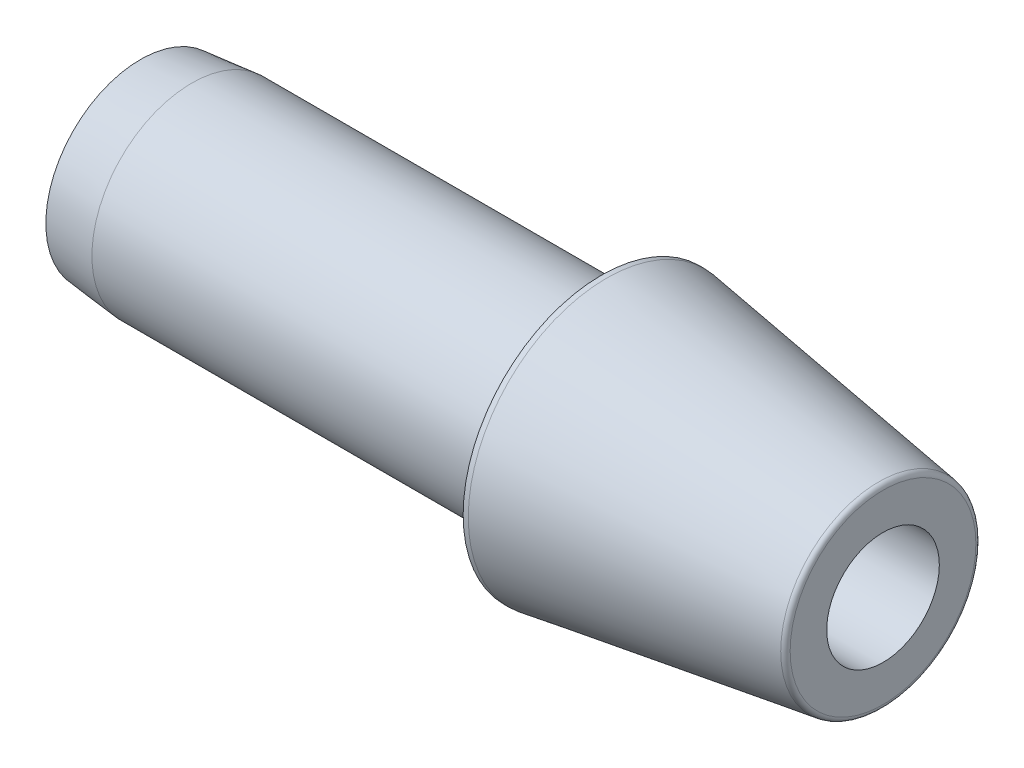
ISO-10303-21;
HEADER;
FILE_DESCRIPTION(('STEP AP214'),'2;1');
FILE_NAME('part.step','',(''),(''),'','','');
FILE_SCHEMA(('AUTOMOTIVE_DESIGN { 1 0 10303 214 1 1 1 1 }'));
ENDSEC;
DATA;
#1=APPLICATION_CONTEXT('core data for automotive mechanical design processes');
#2=APPLICATION_PROTOCOL_DEFINITION('international standard','automotive_design',2000,#1);
#3=PRODUCT_CONTEXT('',#1,'mechanical');
#4=PRODUCT('Part','Part','',(#3));
#5=PRODUCT_RELATED_PRODUCT_CATEGORY('part','',(#4));
#6=PRODUCT_DEFINITION_FORMATION('','',#4);
#7=PRODUCT_DEFINITION_CONTEXT('part definition',#1,'design');
#8=PRODUCT_DEFINITION('design','',#6,#7);
#9=PRODUCT_DEFINITION_SHAPE('','',#8);
#10=(LENGTH_UNIT() NAMED_UNIT(*) SI_UNIT(.MILLI.,.METRE.));
#11=(NAMED_UNIT(*) PLANE_ANGLE_UNIT() SI_UNIT($,.RADIAN.));
#12=(NAMED_UNIT(*) SI_UNIT($,.STERADIAN.) SOLID_ANGLE_UNIT());
#13=UNCERTAINTY_MEASURE_WITH_UNIT(LENGTH_MEASURE(1.E-05),#10,'distance_accuracy_value','');
#14=(GEOMETRIC_REPRESENTATION_CONTEXT(3) GLOBAL_UNCERTAINTY_ASSIGNED_CONTEXT((#13)) GLOBAL_UNIT_ASSIGNED_CONTEXT((#10,
#11,#12)) REPRESENTATION_CONTEXT('',''));
#15=CARTESIAN_POINT('',(0.,0.,0.));
#16=DIRECTION('',(0.,0.,1.));
#17=DIRECTION('',(1.,0.,0.));
#18=AXIS2_PLACEMENT_3D('',#15,#16,#17);
#19=CARTESIAN_POINT('',(0.,0.,0.));
#20=DIRECTION('',(1.,0.,0.));
#21=DIRECTION('',(0.,0.,-1.));
#22=AXIS2_PLACEMENT_3D('',#19,#20,#21);
#23=CYLINDRICAL_SURFACE('',#22,1.1);
#24=CARTESIAN_POINT('',(0.,0.,0.));
#25=DIRECTION('',(1.,0.,0.));
#26=DIRECTION('',(0.,0.,-1.));
#27=AXIS2_PLACEMENT_3D('',#24,#25,#26);
#28=CIRCLE('',#27,1.1);
#29=CARTESIAN_POINT('',(0.,0.,-1.1));
#30=VERTEX_POINT('',#29);
#31=EDGE_CURVE('E94',#30,#30,#28,.F.);
#32=ORIENTED_EDGE('',*,*,#31,.F.);
#33=EDGE_LOOP('',(#32));
#34=FACE_BOUND('',#33,.T.);
#35=CARTESIAN_POINT('',(-6.7,0.,0.));
#36=DIRECTION('',(1.,0.,0.));
#37=DIRECTION('',(0.,0.,-1.));
#38=AXIS2_PLACEMENT_3D('',#35,#36,#37);
#39=CIRCLE('',#38,1.1);
#40=CARTESIAN_POINT('',(-6.7,0.,-1.1));
#41=VERTEX_POINT('',#40);
#42=EDGE_CURVE('E41',#41,#41,#39,.T.);
#43=ORIENTED_EDGE('',*,*,#42,.F.);
#44=EDGE_LOOP('',(#43));
#45=FACE_BOUND('',#44,.T.);
#46=ADVANCED_FACE('F17',(#34,#45),#23,.F.);
#47=CARTESIAN_POINT('',(0.,1.1,0.));
#48=DIRECTION('',(1.,0.,0.));
#49=DIRECTION('',(0.,0.,-1.));
#50=AXIS2_PLACEMENT_3D('',#47,#48,#49);
#51=PLANE('',#50);
#52=ORIENTED_EDGE('',*,*,#31,.T.);
#53=EDGE_LOOP('',(#52));
#54=FACE_BOUND('',#53,.T.);
#55=CARTESIAN_POINT('',(0.,0.,0.));
#56=DIRECTION('',(-1.,0.,0.));
#57=DIRECTION('',(0.,0.,1.));
#58=AXIS2_PLACEMENT_3D('',#55,#56,#57);
#59=CIRCLE('',#58,1.81372337730403);
#60=CARTESIAN_POINT('',(0.,0.,1.81372337730403));
#61=VERTEX_POINT('',#60);
#62=CARTESIAN_POINT('',(0.,0.,-1.81372337730403));
#63=VERTEX_POINT('',#62);
#64=EDGE_CURVE('E34',#61,#63,#59,.T.);
#65=ORIENTED_EDGE('',*,*,#64,.F.);
#66=CARTESIAN_POINT('',(0.,0.,0.));
#67=DIRECTION('',(-1.,0.,0.));
#68=DIRECTION('',(0.,0.,-1.));
#69=AXIS2_PLACEMENT_3D('',#66,#67,#68);
#70=CIRCLE('',#69,1.81372337730403);
#71=EDGE_CURVE('E39',#63,#61,#70,.T.);
#72=ORIENTED_EDGE('',*,*,#71,.F.);
#73=EDGE_LOOP('',(#65,#72));
#74=FACE_BOUND('',#73,.T.);
#75=ADVANCED_FACE('F38',(#54,#74),#51,.T.);
#76=CARTESIAN_POINT('',(-6.7,1.48,0.));
#77=DIRECTION('',(-1.,0.,0.));
#78=DIRECTION('',(0.,0.,1.));
#79=AXIS2_PLACEMENT_3D('',#76,#77,#78);
#80=PLANE('',#79);
#81=CARTESIAN_POINT('',(-6.7,0.,0.));
#82=DIRECTION('',(1.,0.,0.));
#83=DIRECTION('',(0.,0.,-1.));
#84=AXIS2_PLACEMENT_3D('',#81,#82,#83);
#85=CIRCLE('',#84,1.48);
#86=CARTESIAN_POINT('',(-6.7,0.,-1.48));
#87=VERTEX_POINT('',#86);
#88=EDGE_CURVE('E46',#87,#87,#85,.F.);
#89=ORIENTED_EDGE('',*,*,#88,.T.);
#90=EDGE_LOOP('',(#89));
#91=FACE_BOUND('',#90,.T.);
#92=ORIENTED_EDGE('',*,*,#42,.T.);
#93=EDGE_LOOP('',(#92));
#94=FACE_BOUND('',#93,.T.);
#95=ADVANCED_FACE('F64',(#91,#94),#80,.T.);
#96=CARTESIAN_POINT('',(-0.1,0.,0.));
#97=DIRECTION('',(1.,0.,0.));
#98=DIRECTION('',(0.,0.,-1.));
#99=AXIS2_PLACEMENT_3D('',#96,#97,#98);
#100=TOROIDAL_SURFACE('',#99,1.81372337730403,0.1);
#101=CARTESIAN_POINT('',(-0.0853451338684863,0.,0.));
#102=DIRECTION('',(-1.,0.,0.));
#103=DIRECTION('',(0.,0.,1.));
#104=AXIS2_PLACEMENT_3D('',#101,#102,#103);
#105=CIRCLE('',#104,1.91264372354283);
#106=CARTESIAN_POINT('',(-0.0853451338684863,0.,1.91264372354283));
#107=VERTEX_POINT('',#106);
#108=EDGE_CURVE('E70',#107,#107,#105,.T.);
#109=ORIENTED_EDGE('',*,*,#108,.F.);
#110=EDGE_LOOP('',(#109));
#111=FACE_BOUND('',#110,.T.);
#112=ORIENTED_EDGE('',*,*,#71,.T.);
#113=ORIENTED_EDGE('',*,*,#64,.T.);
#114=EDGE_LOOP('',(#112,#113));
#115=FACE_BOUND('',#114,.T.);
#116=ADVANCED_FACE('F45',(#111,#115),#100,.T.);
#117=CARTESIAN_POINT('',(0.,0.,0.));
#118=DIRECTION('',(1.,0.,0.));
#119=DIRECTION('',(0.,0.,-1.));
#120=AXIS2_PLACEMENT_3D('',#117,#118,#119);
#121=CYLINDRICAL_SURFACE('',#120,1.48);
#122=ORIENTED_EDGE('',*,*,#88,.F.);
#123=EDGE_LOOP('',(#122));
#124=FACE_BOUND('',#123,.T.);
#125=CARTESIAN_POINT('',(-14.5,0.,0.));
#126=DIRECTION('',(1.,0.,0.));
#127=DIRECTION('',(0.,0.,-1.));
#128=AXIS2_PLACEMENT_3D('',#125,#126,#127);
#129=CIRCLE('',#128,1.48);
#130=CARTESIAN_POINT('',(-14.5,0.,-1.48));
#131=VERTEX_POINT('',#130);
#132=EDGE_CURVE('E73',#131,#131,#129,.T.);
#133=ORIENTED_EDGE('',*,*,#132,.F.);
#134=EDGE_LOOP('',(#133));
#135=FACE_BOUND('',#134,.T.);
#136=ADVANCED_FACE('F63',(#124,#135),#121,.F.);
#137=CARTESIAN_POINT('',(-5.3999999998382,0.,0.));
#138=DIRECTION('',(-1.,0.,0.));
#139=DIRECTION('',(0.,0.,1.));
#140=AXIS2_PLACEMENT_3D('',#137,#138,#139);
#141=CONICAL_SURFACE('',#140,2.69999999997594,0.147078355387724);
#142=ORIENTED_EDGE('',*,*,#108,.T.);
#143=EDGE_LOOP('',(#142));
#144=FACE_BOUND('',#143,.T.);
#145=CARTESIAN_POINT('',(-5.4,0.,0.));
#146=DIRECTION('',(1.,0.,0.));
#147=DIRECTION('',(0.,0.,-1.));
#148=AXIS2_PLACEMENT_3D('',#145,#146,#147);
#149=CIRCLE('',#148,2.7);
#150=CARTESIAN_POINT('',(-5.4,0.,-2.7));
#151=VERTEX_POINT('',#150);
#152=EDGE_CURVE('E74',#151,#151,#149,.F.);
#153=ORIENTED_EDGE('',*,*,#152,.F.);
#154=EDGE_LOOP('',(#153));
#155=FACE_BOUND('',#154,.T.);
#156=ADVANCED_FACE('F129',(#144,#155),#141,.T.);
#157=CARTESIAN_POINT('',(-14.5,1.85,0.));
#158=DIRECTION('',(-1.,0.,0.));
#159=DIRECTION('',(0.,0.,1.));
#160=AXIS2_PLACEMENT_3D('',#157,#158,#159);
#161=PLANE('',#160);
#162=CARTESIAN_POINT('',(-14.4999999999982,0.,0.));
#163=DIRECTION('',(1.,0.,0.));
#164=DIRECTION('',(0.,0.,-1.));
#165=AXIS2_PLACEMENT_3D('',#162,#163,#164);
#166=CIRCLE('',#165,1.85000000000315);
#167=CARTESIAN_POINT('',(-14.4999999999982,0.,-1.85000000000315));
#168=VERTEX_POINT('',#167);
#169=EDGE_CURVE('E77',#168,#168,#166,.T.);
#170=ORIENTED_EDGE('',*,*,#169,.F.);
#171=EDGE_LOOP('',(#170));
#172=FACE_BOUND('',#171,.T.);
#173=ORIENTED_EDGE('',*,*,#132,.T.);
#174=EDGE_LOOP('',(#173));
#175=FACE_BOUND('',#174,.T.);
#176=ADVANCED_FACE('F126',(#172,#175),#161,.T.);
#177=CARTESIAN_POINT('',(0.,0.,0.));
#178=DIRECTION('',(1.,0.,0.));
#179=DIRECTION('',(0.,0.,-1.));
#180=AXIS2_PLACEMENT_3D('',#177,#178,#179);
#181=CYLINDRICAL_SURFACE('',#180,2.7);
#182=CARTESIAN_POINT('',(-5.5,0.,0.));
#183=DIRECTION('',(1.,0.,0.));
#184=DIRECTION('',(0.,0.,-1.));
#185=AXIS2_PLACEMENT_3D('',#182,#183,#184);
#186=CIRCLE('',#185,2.7);
#187=CARTESIAN_POINT('',(-5.5,0.,-2.7));
#188=VERTEX_POINT('',#187);
#189=EDGE_CURVE('E79',#188,#188,#186,.F.);
#190=ORIENTED_EDGE('',*,*,#189,.F.);
#191=EDGE_LOOP('',(#190));
#192=FACE_BOUND('',#191,.T.);
#193=ORIENTED_EDGE('',*,*,#152,.T.);
#194=EDGE_LOOP('',(#193));
#195=FACE_BOUND('',#194,.T.);
#196=ADVANCED_FACE('F122',(#192,#195),#181,.T.);
#197=CARTESIAN_POINT('',(-13.5000000000787,0.,0.));
#198=DIRECTION('',(1.,0.,0.));
#199=DIRECTION('',(0.,0.,-1.));
#200=AXIS2_PLACEMENT_3D('',#197,#198,#199);
#201=CONICAL_SURFACE('',#200,1.94999999999368,0.099668652489755);
#202=CARTESIAN_POINT('',(-13.5,0.,0.));
#203=DIRECTION('',(1.,0.,0.));
#204=DIRECTION('',(0.,0.,-1.));
#205=AXIS2_PLACEMENT_3D('',#202,#203,#204);
#206=CIRCLE('',#205,1.95);
#207=CARTESIAN_POINT('',(-13.5,0.,-1.95));
#208=VERTEX_POINT('',#207);
#209=EDGE_CURVE('E28',#208,#208,#206,.T.);
#210=ORIENTED_EDGE('',*,*,#209,.F.);
#211=EDGE_LOOP('',(#210));
#212=FACE_BOUND('',#211,.T.);
#213=ORIENTED_EDGE('',*,*,#169,.T.);
#214=EDGE_LOOP('',(#213));
#215=FACE_BOUND('',#214,.T.);
#216=ADVANCED_FACE('F117',(#212,#215),#201,.T.);
#217=CARTESIAN_POINT('',(-5.5,2.7,0.));
#218=DIRECTION('',(-1.,0.,0.));
#219=DIRECTION('',(0.,0.,1.));
#220=AXIS2_PLACEMENT_3D('',#217,#218,#219);
#221=PLANE('',#220);
#222=ORIENTED_EDGE('',*,*,#189,.T.);
#223=EDGE_LOOP('',(#222));
#224=FACE_BOUND('',#223,.T.);
#225=CARTESIAN_POINT('',(-5.5,0.,0.));
#226=DIRECTION('',(1.,0.,0.));
#227=DIRECTION('',(0.,0.,-1.));
#228=AXIS2_PLACEMENT_3D('',#225,#226,#227);
#229=CIRCLE('',#228,1.95);
#230=CARTESIAN_POINT('',(-5.5,0.,-1.95));
#231=VERTEX_POINT('',#230);
#232=EDGE_CURVE('E11',#231,#231,#229,.F.);
#233=ORIENTED_EDGE('',*,*,#232,.F.);
#234=EDGE_LOOP('',(#233));
#235=FACE_BOUND('',#234,.T.);
#236=ADVANCED_FACE('F111',(#224,#235),#221,.T.);
#237=CARTESIAN_POINT('',(0.,0.,0.));
#238=DIRECTION('',(1.,0.,0.));
#239=DIRECTION('',(0.,0.,-1.));
#240=AXIS2_PLACEMENT_3D('',#237,#238,#239);
#241=CYLINDRICAL_SURFACE('',#240,1.95);
#242=ORIENTED_EDGE('',*,*,#232,.T.);
#243=EDGE_LOOP('',(#242));
#244=FACE_BOUND('',#243,.T.);
#245=ORIENTED_EDGE('',*,*,#209,.T.);
#246=EDGE_LOOP('',(#245));
#247=FACE_BOUND('',#246,.T.);
#248=ADVANCED_FACE('F109',(#244,#247),#241,.T.);
#249=CLOSED_SHELL('',(#46,#75,#95,#116,#136,#156,#176,#196,#216,#236,#248));
#250=MANIFOLD_SOLID_BREP('B1',#249);
#251=ADVANCED_BREP_SHAPE_REPRESENTATION('',(#18,#250),#14);
#252=SHAPE_DEFINITION_REPRESENTATION(#9,#251);
ENDSEC;
END-ISO-10303-21;
